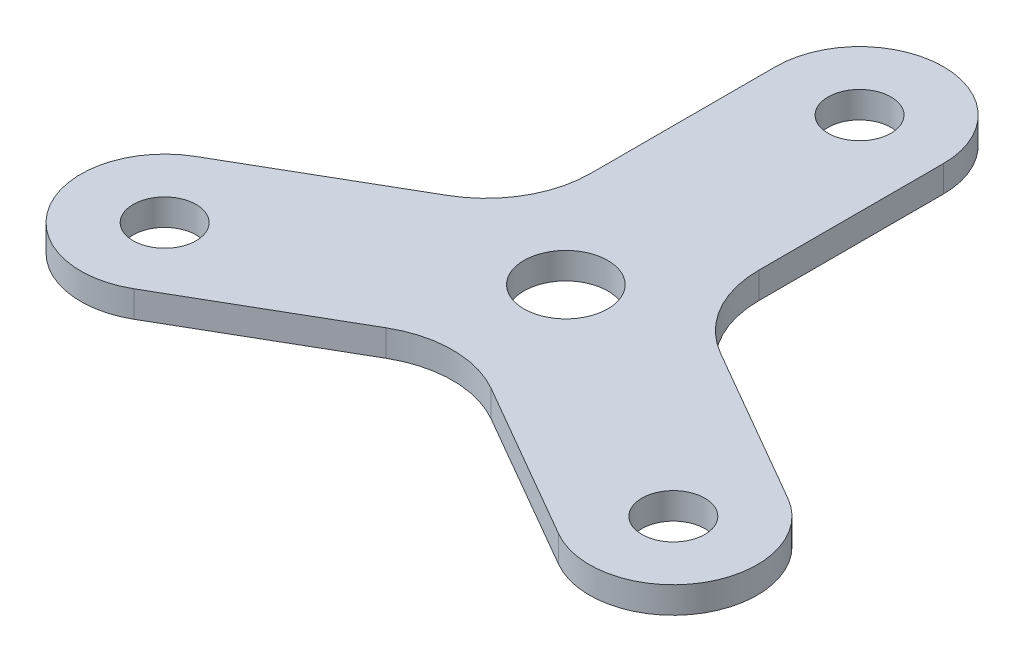
ISO-10303-21;
HEADER;
FILE_DESCRIPTION(('STEP AP214'),'2;1');
FILE_NAME('part.step','',(''),(''),'','','');
FILE_SCHEMA(('AUTOMOTIVE_DESIGN { 1 0 10303 214 1 1 1 1 }'));
ENDSEC;
DATA;
#1=APPLICATION_CONTEXT('core data for automotive mechanical design processes');
#2=APPLICATION_PROTOCOL_DEFINITION('international standard','automotive_design',2000,#1);
#3=PRODUCT_CONTEXT('',#1,'mechanical');
#4=PRODUCT('Part','Part','',(#3));
#5=PRODUCT_RELATED_PRODUCT_CATEGORY('part','',(#4));
#6=PRODUCT_DEFINITION_FORMATION('','',#4);
#7=PRODUCT_DEFINITION_CONTEXT('part definition',#1,'design');
#8=PRODUCT_DEFINITION('design','',#6,#7);
#9=PRODUCT_DEFINITION_SHAPE('','',#8);
#10=(LENGTH_UNIT() NAMED_UNIT(*) SI_UNIT(.MILLI.,.METRE.));
#11=(NAMED_UNIT(*) PLANE_ANGLE_UNIT() SI_UNIT($,.RADIAN.));
#12=(NAMED_UNIT(*) SI_UNIT($,.STERADIAN.) SOLID_ANGLE_UNIT());
#13=UNCERTAINTY_MEASURE_WITH_UNIT(LENGTH_MEASURE(1.E-05),#10,'distance_accuracy_value','');
#14=(GEOMETRIC_REPRESENTATION_CONTEXT(3) GLOBAL_UNCERTAINTY_ASSIGNED_CONTEXT((#13)) GLOBAL_UNIT_ASSIGNED_CONTEXT((#10,
#11,#12)) REPRESENTATION_CONTEXT('',''));
#15=CARTESIAN_POINT('',(0.,0.,0.));
#16=DIRECTION('',(0.,0.,1.));
#17=DIRECTION('',(1.,0.,0.));
#18=AXIS2_PLACEMENT_3D('',#15,#16,#17);
#19=CARTESIAN_POINT('',(-5.08,0.8001,-17.78));
#20=DIRECTION('',(1.,0.,0.));
#21=DIRECTION('',(0.,0.,-1.));
#22=AXIS2_PLACEMENT_3D('',#19,#20,#21);
#23=PLANE('',#22);
#24=DIRECTION('',(0.,0.,1.));
#25=VECTOR('',#24,1.);
#26=CARTESIAN_POINT('',(-5.08,-0.8001,-17.78));
#27=LINE('',#26,#25);
#28=CARTESIAN_POINT('',(-5.08,-0.8001,-17.78));
#29=VERTEX_POINT('',#28);
#30=CARTESIAN_POINT('',(-5.08,-0.8001,-6.59911357683739));
#31=VERTEX_POINT('',#30);
#32=EDGE_CURVE('E224',#29,#31,#27,.T.);
#33=ORIENTED_EDGE('',*,*,#32,.T.);
#34=DIRECTION('',(0.,-1.,0.));
#35=VECTOR('',#34,1.);
#36=CARTESIAN_POINT('',(-5.08,0.8001,-6.59911357683739));
#37=LINE('',#36,#35);
#38=CARTESIAN_POINT('',(-5.08,0.8001,-6.59911357683739));
#39=VERTEX_POINT('',#38);
#40=EDGE_CURVE('E61',#31,#39,#37,.F.);
#41=ORIENTED_EDGE('',*,*,#40,.T.);
#42=DIRECTION('',(0.,0.,1.));
#43=VECTOR('',#42,1.);
#44=CARTESIAN_POINT('',(-5.08,0.8001,-17.78));
#45=LINE('',#44,#43);
#46=CARTESIAN_POINT('',(-5.08,0.8001,-17.78));
#47=VERTEX_POINT('',#46);
#48=EDGE_CURVE('E213',#47,#39,#45,.T.);
#49=ORIENTED_EDGE('',*,*,#48,.F.);
#50=DIRECTION('',(0.,-1.,0.));
#51=VECTOR('',#50,1.);
#52=CARTESIAN_POINT('',(-5.08,0.8001,-17.78));
#53=LINE('',#52,#51);
#54=EDGE_CURVE('E232',#47,#29,#53,.T.);
#55=ORIENTED_EDGE('',*,*,#54,.T.);
#56=EDGE_LOOP('',(#33,#41,#49,#55));
#57=FACE_BOUND('',#56,.T.);
#58=ADVANCED_FACE('F39',(#57),#23,.F.);
#59=CARTESIAN_POINT('',(5.08,0.8001,-17.78));
#60=DIRECTION('',(-1.,0.,0.));
#61=DIRECTION('',(0.,0.,1.));
#62=AXIS2_PLACEMENT_3D('',#59,#60,#61);
#63=PLANE('',#62);
#64=DIRECTION('',(0.,0.,-1.));
#65=VECTOR('',#64,1.);
#66=CARTESIAN_POINT('',(5.08,0.8001,-17.78));
#67=LINE('',#66,#65);
#68=CARTESIAN_POINT('',(5.08,0.8001,-6.59911357683749));
#69=VERTEX_POINT('',#68);
#70=CARTESIAN_POINT('',(5.08,0.8001,-17.78));
#71=VERTEX_POINT('',#70);
#72=EDGE_CURVE('E217',#69,#71,#67,.T.);
#73=ORIENTED_EDGE('',*,*,#72,.F.);
#74=DIRECTION('',(0.,1.,0.));
#75=VECTOR('',#74,1.);
#76=CARTESIAN_POINT('',(5.08,-0.8001,-6.59911357683749));
#77=LINE('',#76,#75);
#78=CARTESIAN_POINT('',(5.08,-0.8001,-6.59911357683749));
#79=VERTEX_POINT('',#78);
#80=EDGE_CURVE('E245',#69,#79,#77,.F.);
#81=ORIENTED_EDGE('',*,*,#80,.T.);
#82=DIRECTION('',(0.,0.,-1.));
#83=VECTOR('',#82,1.);
#84=CARTESIAN_POINT('',(5.08,-0.8001,-17.78));
#85=LINE('',#84,#83);
#86=CARTESIAN_POINT('',(5.08,-0.8001,-17.78));
#87=VERTEX_POINT('',#86);
#88=EDGE_CURVE('E214',#79,#87,#85,.T.);
#89=ORIENTED_EDGE('',*,*,#88,.T.);
#90=DIRECTION('',(0.,-1.,0.));
#91=VECTOR('',#90,1.);
#92=CARTESIAN_POINT('',(5.08,0.8001,-17.78));
#93=LINE('',#92,#91);
#94=EDGE_CURVE('E220',#71,#87,#93,.T.);
#95=ORIENTED_EDGE('',*,*,#94,.F.);
#96=EDGE_LOOP('',(#73,#81,#89,#95));
#97=FACE_BOUND('',#96,.T.);
#98=ADVANCED_FACE('F280',(#97),#63,.F.);
#99=CARTESIAN_POINT('',(0.,0.8001,-17.78));
#100=DIRECTION('',(0.,-1.,0.));
#101=DIRECTION('',(0.,0.,-1.));
#102=AXIS2_PLACEMENT_3D('',#99,#100,#101);
#103=PLANE('',#102);
#104=CARTESIAN_POINT('',(0.,0.8001,0.));
#105=DIRECTION('',(0.,1.,0.));
#106=DIRECTION('',(0.,0.,1.));
#107=AXIS2_PLACEMENT_3D('',#104,#105,#106);
#108=CIRCLE('',#107,2.54);
#109=CARTESIAN_POINT('',(0.,0.8001,2.54));
#110=VERTEX_POINT('',#109);
#111=EDGE_CURVE('E321',#110,#110,#108,.T.);
#112=ORIENTED_EDGE('',*,*,#111,.F.);
#113=EDGE_LOOP('',(#112));
#114=FACE_BOUND('',#113,.T.);
#115=ORIENTED_EDGE('',*,*,#48,.T.);
#116=CARTESIAN_POINT('',(-11.43,0.8001,-6.59911357683739));
#117=DIRECTION('',(0.,-1.,0.));
#118=DIRECTION('',(0.,0.,-1.));
#119=AXIS2_PLACEMENT_3D('',#116,#117,#118);
#120=CIRCLE('',#119,6.35);
#121=CARTESIAN_POINT('',(-8.25499999999997,0.8001,-1.09985226280622));
#122=VERTEX_POINT('',#121);
#123=EDGE_CURVE('E11',#39,#122,#120,.T.);
#124=ORIENTED_EDGE('',*,*,#123,.T.);
#125=DIRECTION('',(-0.866025403784436,0.,0.500000000000004));
#126=VECTOR('',#125,1.);
#127=CARTESIAN_POINT('',(-17.9379316792873,0.8001,4.49059094877513));
#128=LINE('',#127,#126);
#129=CARTESIAN_POINT('',(-17.9379316792873,0.8001,4.49059094877513));
#130=VERTEX_POINT('',#129);
#131=EDGE_CURVE('E180',#122,#130,#128,.T.);
#132=ORIENTED_EDGE('',*,*,#131,.T.);
#133=CARTESIAN_POINT('',(-15.3979316792873,0.8001,8.89000000000007));
#134=DIRECTION('',(0.,1.,0.));
#135=DIRECTION('',(-0.866025403784436,0.,0.500000000000004));
#136=AXIS2_PLACEMENT_3D('',#133,#134,#135);
#137=CIRCLE('',#136,5.08);
#138=CARTESIAN_POINT('',(-12.8579316792873,0.8001,13.289409051225));
#139=VERTEX_POINT('',#138);
#140=EDGE_CURVE('E171',#130,#139,#137,.T.);
#141=ORIENTED_EDGE('',*,*,#140,.T.);
#142=DIRECTION('',(0.866025403784437,0.,-0.500000000000004));
#143=VECTOR('',#142,1.);
#144=CARTESIAN_POINT('',(-12.8579316792873,0.8001,13.289409051225));
#145=LINE('',#144,#143);
#146=CARTESIAN_POINT('',(-3.17499999999993,0.8001,7.69896583964366));
#147=VERTEX_POINT('',#146);
#148=EDGE_CURVE('E175',#139,#147,#145,.T.);
#149=ORIENTED_EDGE('',*,*,#148,.T.);
#150=CARTESIAN_POINT('',(0.,0.8001,13.1982271536748));
#151=DIRECTION('',(0.,-1.,0.));
#152=DIRECTION('',(0.,0.,-1.));
#153=AXIS2_PLACEMENT_3D('',#150,#151,#152);
#154=CIRCLE('',#153,6.35);
#155=CARTESIAN_POINT('',(3.17500000000004,0.8001,7.69896583964362));
#156=VERTEX_POINT('',#155);
#157=EDGE_CURVE('E257',#147,#156,#154,.T.);
#158=ORIENTED_EDGE('',*,*,#157,.T.);
#159=DIRECTION('',(0.866025403784443,0.,0.499999999999992));
#160=VECTOR('',#159,1.);
#161=CARTESIAN_POINT('',(12.8579316792874,0.8001,13.2894090512248));
#162=LINE('',#161,#160);
#163=CARTESIAN_POINT('',(12.8579316792874,0.8001,13.2894090512248));
#164=VERTEX_POINT('',#163);
#165=EDGE_CURVE('E139',#156,#164,#162,.T.);
#166=ORIENTED_EDGE('',*,*,#165,.T.);
#167=CARTESIAN_POINT('',(15.3979316792874,0.8001,8.88999999999986));
#168=DIRECTION('',(0.,1.,0.));
#169=DIRECTION('',(0.866025403784443,0.,0.499999999999992));
#170=AXIS2_PLACEMENT_3D('',#167,#168,#169);
#171=CIRCLE('',#170,5.08);
#172=CARTESIAN_POINT('',(17.9379316792874,0.8001,4.49059094877488));
#173=VERTEX_POINT('',#172);
#174=EDGE_CURVE('E140',#164,#173,#171,.T.);
#175=ORIENTED_EDGE('',*,*,#174,.T.);
#176=DIRECTION('',(-0.866025403784443,0.,-0.499999999999992));
#177=VECTOR('',#176,1.);
#178=CARTESIAN_POINT('',(17.9379316792874,0.8001,4.49059094877488));
#179=LINE('',#178,#177);
#180=CARTESIAN_POINT('',(8.25500000000005,0.8001,-1.09985226280628));
#181=VERTEX_POINT('',#180);
#182=EDGE_CURVE('E128',#173,#181,#179,.T.);
#183=ORIENTED_EDGE('',*,*,#182,.T.);
#184=CARTESIAN_POINT('',(11.43,0.8001,-6.5991135768375));
#185=DIRECTION('',(0.,-1.,0.));
#186=DIRECTION('',(0.,0.,-1.));
#187=AXIS2_PLACEMENT_3D('',#184,#185,#186);
#188=CIRCLE('',#187,6.35);
#189=EDGE_CURVE('E260',#181,#69,#188,.T.);
#190=ORIENTED_EDGE('',*,*,#189,.T.);
#191=ORIENTED_EDGE('',*,*,#72,.T.);
#192=CARTESIAN_POINT('',(0.,0.8001,-17.78));
#193=DIRECTION('',(0.,1.,0.));
#194=DIRECTION('',(0.,0.,-1.));
#195=AXIS2_PLACEMENT_3D('',#192,#193,#194);
#196=CIRCLE('',#195,5.08);
#197=EDGE_CURVE('E209',#71,#47,#196,.T.);
#198=ORIENTED_EDGE('',*,*,#197,.T.);
#199=EDGE_LOOP('',(#115,#124,#132,#141,#149,#158,#166,#175,#183,#190,#191,#198));
#200=FACE_BOUND('',#199,.T.);
#201=CARTESIAN_POINT('',(15.3979316792874,0.8001,8.88999999999986));
#202=DIRECTION('',(0.,1.,0.));
#203=DIRECTION('',(-0.866025403784443,0.,-0.499999999999992));
#204=AXIS2_PLACEMENT_3D('',#201,#202,#203);
#205=CIRCLE('',#204,1.905);
#206=CARTESIAN_POINT('',(13.748153285078,0.8001,7.93749999999987));
#207=VERTEX_POINT('',#206);
#208=EDGE_CURVE('E310',#207,#207,#205,.T.);
#209=ORIENTED_EDGE('',*,*,#208,.F.);
#210=EDGE_LOOP('',(#209));
#211=FACE_BOUND('',#210,.T.);
#212=CARTESIAN_POINT('',(-15.3979316792873,0.8001,8.89000000000007));
#213=DIRECTION('',(0.,1.,0.));
#214=DIRECTION('',(0.866025403784436,0.,-0.500000000000004));
#215=AXIS2_PLACEMENT_3D('',#212,#213,#214);
#216=CIRCLE('',#215,1.905);
#217=CARTESIAN_POINT('',(-13.7481532850779,0.8001,7.93750000000006));
#218=VERTEX_POINT('',#217);
#219=EDGE_CURVE('E162',#218,#218,#216,.T.);
#220=ORIENTED_EDGE('',*,*,#219,.F.);
#221=EDGE_LOOP('',(#220));
#222=FACE_BOUND('',#221,.T.);
#223=CARTESIAN_POINT('',(0.,0.8001,-17.78));
#224=DIRECTION('',(0.,1.,0.));
#225=DIRECTION('',(0.,0.,1.));
#226=AXIS2_PLACEMENT_3D('',#223,#224,#225);
#227=CIRCLE('',#226,1.905);
#228=CARTESIAN_POINT('',(0.,0.8001,-15.875));
#229=VERTEX_POINT('',#228);
#230=EDGE_CURVE('E201',#229,#229,#227,.T.);
#231=ORIENTED_EDGE('',*,*,#230,.F.);
#232=EDGE_LOOP('',(#231));
#233=FACE_BOUND('',#232,.T.);
#234=ADVANCED_FACE('F143',(#114,#200,#211,#222,#233),#103,.F.);
#235=CARTESIAN_POINT('',(0.,-0.8001,-17.78));
#236=DIRECTION('',(0.,-1.,0.));
#237=DIRECTION('',(0.,0.,-1.));
#238=AXIS2_PLACEMENT_3D('',#235,#236,#237);
#239=PLANE('',#238);
#240=CARTESIAN_POINT('',(0.,-0.8001,0.));
#241=DIRECTION('',(0.,1.,0.));
#242=DIRECTION('',(0.,0.,1.));
#243=AXIS2_PLACEMENT_3D('',#240,#241,#242);
#244=CIRCLE('',#243,2.54);
#245=CARTESIAN_POINT('',(0.,-0.8001,2.54));
#246=VERTEX_POINT('',#245);
#247=EDGE_CURVE('E317',#246,#246,#244,.T.);
#248=ORIENTED_EDGE('',*,*,#247,.T.);
#249=EDGE_LOOP('',(#248));
#250=FACE_BOUND('',#249,.T.);
#251=DIRECTION('',(-0.866025403784436,0.,0.500000000000004));
#252=VECTOR('',#251,1.);
#253=CARTESIAN_POINT('',(-17.9379316792873,-0.8001,4.49059094877513));
#254=LINE('',#253,#252);
#255=CARTESIAN_POINT('',(-8.25499999999997,-0.8001,-1.09985226280622));
#256=VERTEX_POINT('',#255);
#257=CARTESIAN_POINT('',(-17.9379316792873,-0.8001,4.49059094877513));
#258=VERTEX_POINT('',#257);
#259=EDGE_CURVE('E176',#256,#258,#254,.T.);
#260=ORIENTED_EDGE('',*,*,#259,.F.);
#261=CARTESIAN_POINT('',(-11.43,-0.8001,-6.59911357683739));
#262=DIRECTION('',(0.,-1.,0.));
#263=DIRECTION('',(0.,0.,-1.));
#264=AXIS2_PLACEMENT_3D('',#261,#262,#263);
#265=CIRCLE('',#264,6.35);
#266=EDGE_CURVE('E48',#256,#31,#265,.F.);
#267=ORIENTED_EDGE('',*,*,#266,.T.);
#268=ORIENTED_EDGE('',*,*,#32,.F.);
#269=CARTESIAN_POINT('',(0.,-0.8001,-17.78));
#270=DIRECTION('',(0.,1.,0.));
#271=DIRECTION('',(0.,0.,-1.));
#272=AXIS2_PLACEMENT_3D('',#269,#270,#271);
#273=CIRCLE('',#272,5.08);
#274=EDGE_CURVE('E205',#87,#29,#273,.T.);
#275=ORIENTED_EDGE('',*,*,#274,.F.);
#276=ORIENTED_EDGE('',*,*,#88,.F.);
#277=CARTESIAN_POINT('',(11.43,-0.8001,-6.5991135768375));
#278=DIRECTION('',(0.,-1.,0.));
#279=DIRECTION('',(0.,0.,-1.));
#280=AXIS2_PLACEMENT_3D('',#277,#278,#279);
#281=CIRCLE('',#280,6.35);
#282=CARTESIAN_POINT('',(8.25500000000005,-0.8001,-1.09985226280628));
#283=VERTEX_POINT('',#282);
#284=EDGE_CURVE('E263',#79,#283,#281,.F.);
#285=ORIENTED_EDGE('',*,*,#284,.T.);
#286=DIRECTION('',(-0.866025403784443,0.,-0.499999999999992));
#287=VECTOR('',#286,1.);
#288=CARTESIAN_POINT('',(17.9379316792874,-0.8001,4.49059094877488));
#289=LINE('',#288,#287);
#290=CARTESIAN_POINT('',(17.9379316792874,-0.8001,4.49059094877488));
#291=VERTEX_POINT('',#290);
#292=EDGE_CURVE('E270',#291,#283,#289,.T.);
#293=ORIENTED_EDGE('',*,*,#292,.F.);
#294=CARTESIAN_POINT('',(15.3979316792874,-0.8001,8.88999999999986));
#295=DIRECTION('',(0.,1.,0.));
#296=DIRECTION('',(0.866025403784443,0.,0.499999999999992));
#297=AXIS2_PLACEMENT_3D('',#294,#295,#296);
#298=CIRCLE('',#297,5.08);
#299=CARTESIAN_POINT('',(12.8579316792874,-0.8001,13.2894090512248));
#300=VERTEX_POINT('',#299);
#301=EDGE_CURVE('E154',#300,#291,#298,.T.);
#302=ORIENTED_EDGE('',*,*,#301,.F.);
#303=DIRECTION('',(0.866025403784443,0.,0.499999999999992));
#304=VECTOR('',#303,1.);
#305=CARTESIAN_POINT('',(12.8579316792874,-0.8001,13.2894090512248));
#306=LINE('',#305,#304);
#307=CARTESIAN_POINT('',(3.17500000000004,-0.8001,7.69896583964362));
#308=VERTEX_POINT('',#307);
#309=EDGE_CURVE('E150',#308,#300,#306,.T.);
#310=ORIENTED_EDGE('',*,*,#309,.F.);
#311=CARTESIAN_POINT('',(0.,-0.8001,13.1982271536748));
#312=DIRECTION('',(0.,-1.,0.));
#313=DIRECTION('',(0.,0.,-1.));
#314=AXIS2_PLACEMENT_3D('',#311,#312,#313);
#315=CIRCLE('',#314,6.35);
#316=CARTESIAN_POINT('',(-3.17499999999993,-0.8001,7.69896583964366));
#317=VERTEX_POINT('',#316);
#318=EDGE_CURVE('E254',#308,#317,#315,.F.);
#319=ORIENTED_EDGE('',*,*,#318,.T.);
#320=DIRECTION('',(0.866025403784437,0.,-0.500000000000004));
#321=VECTOR('',#320,1.);
#322=CARTESIAN_POINT('',(-12.8579316792873,-0.8001,13.289409051225));
#323=LINE('',#322,#321);
#324=CARTESIAN_POINT('',(-12.8579316792873,-0.8001,13.289409051225));
#325=VERTEX_POINT('',#324);
#326=EDGE_CURVE('E187',#325,#317,#323,.T.);
#327=ORIENTED_EDGE('',*,*,#326,.F.);
#328=CARTESIAN_POINT('',(-15.3979316792873,-0.8001,8.89000000000007));
#329=DIRECTION('',(0.,1.,0.));
#330=DIRECTION('',(-0.866025403784436,0.,0.500000000000004));
#331=AXIS2_PLACEMENT_3D('',#328,#329,#330);
#332=CIRCLE('',#331,5.08);
#333=EDGE_CURVE('E169',#258,#325,#332,.T.);
#334=ORIENTED_EDGE('',*,*,#333,.F.);
#335=EDGE_LOOP('',(#260,#267,#268,#275,#276,#285,#293,#302,#310,#319,#327,#334));
#336=FACE_BOUND('',#335,.T.);
#337=CARTESIAN_POINT('',(15.3979316792874,-0.8001,8.88999999999986));
#338=DIRECTION('',(0.,1.,0.));
#339=DIRECTION('',(-0.866025403784443,0.,-0.499999999999992));
#340=AXIS2_PLACEMENT_3D('',#337,#338,#339);
#341=CIRCLE('',#340,1.905);
#342=CARTESIAN_POINT('',(13.748153285078,-0.8001,7.93749999999987));
#343=VERTEX_POINT('',#342);
#344=EDGE_CURVE('E313',#343,#343,#341,.T.);
#345=ORIENTED_EDGE('',*,*,#344,.T.);
#346=EDGE_LOOP('',(#345));
#347=FACE_BOUND('',#346,.T.);
#348=CARTESIAN_POINT('',(-15.3979316792873,-0.8001,8.89000000000007));
#349=DIRECTION('',(0.,1.,0.));
#350=DIRECTION('',(0.866025403784436,0.,-0.500000000000004));
#351=AXIS2_PLACEMENT_3D('',#348,#349,#350);
#352=CIRCLE('',#351,1.905);
#353=CARTESIAN_POINT('',(-13.7481532850779,-0.8001,7.93750000000006));
#354=VERTEX_POINT('',#353);
#355=EDGE_CURVE('E156',#354,#354,#352,.T.);
#356=ORIENTED_EDGE('',*,*,#355,.T.);
#357=EDGE_LOOP('',(#356));
#358=FACE_BOUND('',#357,.T.);
#359=CARTESIAN_POINT('',(0.,-0.8001,-17.78));
#360=DIRECTION('',(0.,1.,0.));
#361=DIRECTION('',(0.,0.,1.));
#362=AXIS2_PLACEMENT_3D('',#359,#360,#361);
#363=CIRCLE('',#362,1.905);
#364=CARTESIAN_POINT('',(0.,-0.8001,-15.875));
#365=VERTEX_POINT('',#364);
#366=EDGE_CURVE('E200',#365,#365,#363,.T.);
#367=ORIENTED_EDGE('',*,*,#366,.T.);
#368=EDGE_LOOP('',(#367));
#369=FACE_BOUND('',#368,.T.);
#370=ADVANCED_FACE('F268',(#250,#336,#347,#358,#369),#239,.T.);
#371=CARTESIAN_POINT('',(0.,0.8001,-17.78));
#372=DIRECTION('',(0.,-1.,0.));
#373=DIRECTION('',(0.,0.,-1.));
#374=AXIS2_PLACEMENT_3D('',#371,#372,#373);
#375=CYLINDRICAL_SURFACE('',#374,5.08);
#376=ORIENTED_EDGE('',*,*,#274,.T.);
#377=ORIENTED_EDGE('',*,*,#54,.F.);
#378=ORIENTED_EDGE('',*,*,#197,.F.);
#379=ORIENTED_EDGE('',*,*,#94,.T.);
#380=EDGE_LOOP('',(#376,#377,#378,#379));
#381=FACE_BOUND('',#380,.T.);
#382=ADVANCED_FACE('F284',(#381),#375,.T.);
#383=CARTESIAN_POINT('',(0.,0.8001,-17.78));
#384=DIRECTION('',(0.,-1.,0.));
#385=DIRECTION('',(0.,0.,-1.));
#386=AXIS2_PLACEMENT_3D('',#383,#384,#385);
#387=CYLINDRICAL_SURFACE('',#386,1.905);
#388=ORIENTED_EDGE('',*,*,#230,.T.);
#389=EDGE_LOOP('',(#388));
#390=FACE_BOUND('',#389,.T.);
#391=ORIENTED_EDGE('',*,*,#366,.F.);
#392=EDGE_LOOP('',(#391));
#393=FACE_BOUND('',#392,.T.);
#394=ADVANCED_FACE('F353',(#390,#393),#387,.F.);
#395=CARTESIAN_POINT('',(-17.9379316792873,0.8001,4.49059094877513));
#396=DIRECTION('',(0.500000000000004,0.,0.866025403784436));
#397=DIRECTION('',(0.866025403784436,0.,-0.500000000000004));
#398=AXIS2_PLACEMENT_3D('',#395,#396,#397);
#399=PLANE('',#398);
#400=ORIENTED_EDGE('',*,*,#131,.F.);
#401=DIRECTION('',(0.,-1.,0.));
#402=VECTOR('',#401,1.);
#403=CARTESIAN_POINT('',(-8.25499999999997,-0.8001,-1.09985226280622));
#404=LINE('',#403,#402);
#405=EDGE_CURVE('E248',#122,#256,#404,.T.);
#406=ORIENTED_EDGE('',*,*,#405,.T.);
#407=ORIENTED_EDGE('',*,*,#259,.T.);
#408=DIRECTION('',(0.,-1.,0.));
#409=VECTOR('',#408,1.);
#410=CARTESIAN_POINT('',(-17.9379316792873,0.8001,4.49059094877513));
#411=LINE('',#410,#409);
#412=EDGE_CURVE('E183',#130,#258,#411,.T.);
#413=ORIENTED_EDGE('',*,*,#412,.F.);
#414=EDGE_LOOP('',(#400,#406,#407,#413));
#415=FACE_BOUND('',#414,.T.);
#416=ADVANCED_FACE('F290',(#415),#399,.F.);
#417=CARTESIAN_POINT('',(17.9379316792874,0.8001,4.49059094877488));
#418=DIRECTION('',(-0.499999999999992,0.,0.866025403784443));
#419=DIRECTION('',(0.866025403784443,0.,0.499999999999992));
#420=AXIS2_PLACEMENT_3D('',#417,#418,#419);
#421=PLANE('',#420);
#422=ORIENTED_EDGE('',*,*,#292,.T.);
#423=DIRECTION('',(0.,1.,0.));
#424=VECTOR('',#423,1.);
#425=CARTESIAN_POINT('',(8.25500000000005,0.8001,-1.09985226280628));
#426=LINE('',#425,#424);
#427=EDGE_CURVE('E136',#283,#181,#426,.T.);
#428=ORIENTED_EDGE('',*,*,#427,.T.);
#429=ORIENTED_EDGE('',*,*,#182,.F.);
#430=DIRECTION('',(0.,-1.,0.));
#431=VECTOR('',#430,1.);
#432=CARTESIAN_POINT('',(17.9379316792874,0.8001,4.49059094877488));
#433=LINE('',#432,#431);
#434=EDGE_CURVE('E133',#173,#291,#433,.T.);
#435=ORIENTED_EDGE('',*,*,#434,.T.);
#436=EDGE_LOOP('',(#422,#428,#429,#435));
#437=FACE_BOUND('',#436,.T.);
#438=ADVANCED_FACE('F131',(#437),#421,.F.);
#439=CARTESIAN_POINT('',(-12.8579316792873,0.8001,13.289409051225));
#440=DIRECTION('',(-0.500000000000004,0.,-0.866025403784436));
#441=DIRECTION('',(-0.866025403784436,0.,0.500000000000004));
#442=AXIS2_PLACEMENT_3D('',#439,#440,#441);
#443=PLANE('',#442);
#444=ORIENTED_EDGE('',*,*,#326,.T.);
#445=DIRECTION('',(0.,-1.,0.));
#446=VECTOR('',#445,1.);
#447=CARTESIAN_POINT('',(-3.17499999999993,0.8001,7.69896583964366));
#448=LINE('',#447,#446);
#449=EDGE_CURVE('E240',#317,#147,#448,.F.);
#450=ORIENTED_EDGE('',*,*,#449,.T.);
#451=ORIENTED_EDGE('',*,*,#148,.F.);
#452=DIRECTION('',(0.,-1.,0.));
#453=VECTOR('',#452,1.);
#454=CARTESIAN_POINT('',(-12.8579316792873,0.8001,13.289409051225));
#455=LINE('',#454,#453);
#456=EDGE_CURVE('E196',#139,#325,#455,.T.);
#457=ORIENTED_EDGE('',*,*,#456,.T.);
#458=EDGE_LOOP('',(#444,#450,#451,#457));
#459=FACE_BOUND('',#458,.T.);
#460=ADVANCED_FACE('F390',(#459),#443,.F.);
#461=CARTESIAN_POINT('',(-15.3979316792873,0.8001,8.89000000000007));
#462=DIRECTION('',(0.,-1.,0.));
#463=DIRECTION('',(0.,0.,-1.));
#464=AXIS2_PLACEMENT_3D('',#461,#462,#463);
#465=CYLINDRICAL_SURFACE('',#464,5.08);
#466=ORIENTED_EDGE('',*,*,#333,.T.);
#467=ORIENTED_EDGE('',*,*,#456,.F.);
#468=ORIENTED_EDGE('',*,*,#140,.F.);
#469=ORIENTED_EDGE('',*,*,#412,.T.);
#470=EDGE_LOOP('',(#466,#467,#468,#469));
#471=FACE_BOUND('',#470,.T.);
#472=ADVANCED_FACE('F295',(#471),#465,.T.);
#473=CARTESIAN_POINT('',(-15.3979316792873,0.8001,8.89000000000007));
#474=DIRECTION('',(0.,-1.,0.));
#475=DIRECTION('',(0.,0.,-1.));
#476=AXIS2_PLACEMENT_3D('',#473,#474,#475);
#477=CYLINDRICAL_SURFACE('',#476,1.905);
#478=ORIENTED_EDGE('',*,*,#219,.T.);
#479=EDGE_LOOP('',(#478));
#480=FACE_BOUND('',#479,.T.);
#481=ORIENTED_EDGE('',*,*,#355,.F.);
#482=EDGE_LOOP('',(#481));
#483=FACE_BOUND('',#482,.T.);
#484=ADVANCED_FACE('F381',(#480,#483),#477,.F.);
#485=CARTESIAN_POINT('',(12.8579316792874,0.8001,13.2894090512248));
#486=DIRECTION('',(0.499999999999992,0.,-0.866025403784443));
#487=DIRECTION('',(-0.866025403784443,0.,-0.499999999999992));
#488=AXIS2_PLACEMENT_3D('',#485,#486,#487);
#489=PLANE('',#488);
#490=ORIENTED_EDGE('',*,*,#165,.F.);
#491=DIRECTION('',(0.,-1.,0.));
#492=VECTOR('',#491,1.);
#493=CARTESIAN_POINT('',(3.17500000000004,-0.8001,7.69896583964362));
#494=LINE('',#493,#492);
#495=EDGE_CURVE('E236',#156,#308,#494,.T.);
#496=ORIENTED_EDGE('',*,*,#495,.T.);
#497=ORIENTED_EDGE('',*,*,#309,.T.);
#498=DIRECTION('',(0.,-1.,0.));
#499=VECTOR('',#498,1.);
#500=CARTESIAN_POINT('',(12.8579316792874,0.8001,13.2894090512248));
#501=LINE('',#500,#499);
#502=EDGE_CURVE('E157',#164,#300,#501,.T.);
#503=ORIENTED_EDGE('',*,*,#502,.F.);
#504=EDGE_LOOP('',(#490,#496,#497,#503));
#505=FACE_BOUND('',#504,.T.);
#506=ADVANCED_FACE('F305',(#505),#489,.F.);
#507=CARTESIAN_POINT('',(15.3979316792874,0.8001,8.88999999999986));
#508=DIRECTION('',(0.,-1.,0.));
#509=DIRECTION('',(0.,0.,-1.));
#510=AXIS2_PLACEMENT_3D('',#507,#508,#509);
#511=CYLINDRICAL_SURFACE('',#510,5.08);
#512=ORIENTED_EDGE('',*,*,#301,.T.);
#513=ORIENTED_EDGE('',*,*,#434,.F.);
#514=ORIENTED_EDGE('',*,*,#174,.F.);
#515=ORIENTED_EDGE('',*,*,#502,.T.);
#516=EDGE_LOOP('',(#512,#513,#514,#515));
#517=FACE_BOUND('',#516,.T.);
#518=ADVANCED_FACE('F152',(#517),#511,.T.);
#519=CARTESIAN_POINT('',(15.3979316792874,0.8001,8.88999999999986));
#520=DIRECTION('',(0.,-1.,0.));
#521=DIRECTION('',(0.,0.,-1.));
#522=AXIS2_PLACEMENT_3D('',#519,#520,#521);
#523=CYLINDRICAL_SURFACE('',#522,1.905);
#524=ORIENTED_EDGE('',*,*,#208,.T.);
#525=EDGE_LOOP('',(#524));
#526=FACE_BOUND('',#525,.T.);
#527=ORIENTED_EDGE('',*,*,#344,.F.);
#528=EDGE_LOOP('',(#527));
#529=FACE_BOUND('',#528,.T.);
#530=ADVANCED_FACE('F333',(#526,#529),#523,.F.);
#531=CARTESIAN_POINT('',(0.,-0.8001,0.));
#532=DIRECTION('',(0.,1.,0.));
#533=DIRECTION('',(0.,0.,1.));
#534=AXIS2_PLACEMENT_3D('',#531,#532,#533);
#535=CYLINDRICAL_SURFACE('',#534,2.54);
#536=ORIENTED_EDGE('',*,*,#247,.F.);
#537=EDGE_LOOP('',(#536));
#538=FACE_BOUND('',#537,.T.);
#539=ORIENTED_EDGE('',*,*,#111,.T.);
#540=EDGE_LOOP('',(#539));
#541=FACE_BOUND('',#540,.T.);
#542=ADVANCED_FACE('F330',(#538,#541),#535,.F.);
#543=CARTESIAN_POINT('',(0.,0.8001,13.1982271536748));
#544=DIRECTION('',(0.,1.,0.));
#545=DIRECTION('',(0.,0.,1.));
#546=AXIS2_PLACEMENT_3D('',#543,#544,#545);
#547=CYLINDRICAL_SURFACE('',#546,6.35);
#548=ORIENTED_EDGE('',*,*,#157,.F.);
#549=ORIENTED_EDGE('',*,*,#449,.F.);
#550=ORIENTED_EDGE('',*,*,#318,.F.);
#551=ORIENTED_EDGE('',*,*,#495,.F.);
#552=EDGE_LOOP('',(#548,#549,#550,#551));
#553=FACE_BOUND('',#552,.T.);
#554=ADVANCED_FACE('F302',(#553),#547,.F.);
#555=CARTESIAN_POINT('',(11.43,0.8001,-6.5991135768375));
#556=DIRECTION('',(0.,-1.,0.));
#557=DIRECTION('',(0.,0.,-1.));
#558=AXIS2_PLACEMENT_3D('',#555,#556,#557);
#559=CYLINDRICAL_SURFACE('',#558,6.35);
#560=ORIENTED_EDGE('',*,*,#284,.F.);
#561=ORIENTED_EDGE('',*,*,#80,.F.);
#562=ORIENTED_EDGE('',*,*,#189,.F.);
#563=ORIENTED_EDGE('',*,*,#427,.F.);
#564=EDGE_LOOP('',(#560,#561,#562,#563));
#565=FACE_BOUND('',#564,.T.);
#566=ADVANCED_FACE('F276',(#565),#559,.F.);
#567=CARTESIAN_POINT('',(-11.43,0.8001,-6.59911357683739));
#568=DIRECTION('',(0.,1.,0.));
#569=DIRECTION('',(0.,0.,1.));
#570=AXIS2_PLACEMENT_3D('',#567,#568,#569);
#571=CYLINDRICAL_SURFACE('',#570,6.35);
#572=ORIENTED_EDGE('',*,*,#123,.F.);
#573=ORIENTED_EDGE('',*,*,#40,.F.);
#574=ORIENTED_EDGE('',*,*,#266,.F.);
#575=ORIENTED_EDGE('',*,*,#405,.F.);
#576=EDGE_LOOP('',(#572,#573,#574,#575));
#577=FACE_BOUND('',#576,.T.);
#578=ADVANCED_FACE('F41',(#577),#571,.F.);
#579=CLOSED_SHELL('',(#58,#98,#234,#370,#382,#394,#416,#438,#460,#472,#484,#506,#518,#530,#542,
#554,#566,#578));
#580=MANIFOLD_SOLID_BREP('B2',#579);
#581=ADVANCED_BREP_SHAPE_REPRESENTATION('',(#18,#580),#14);
#582=SHAPE_DEFINITION_REPRESENTATION(#9,#581);
ENDSEC;
END-ISO-10303-21;
